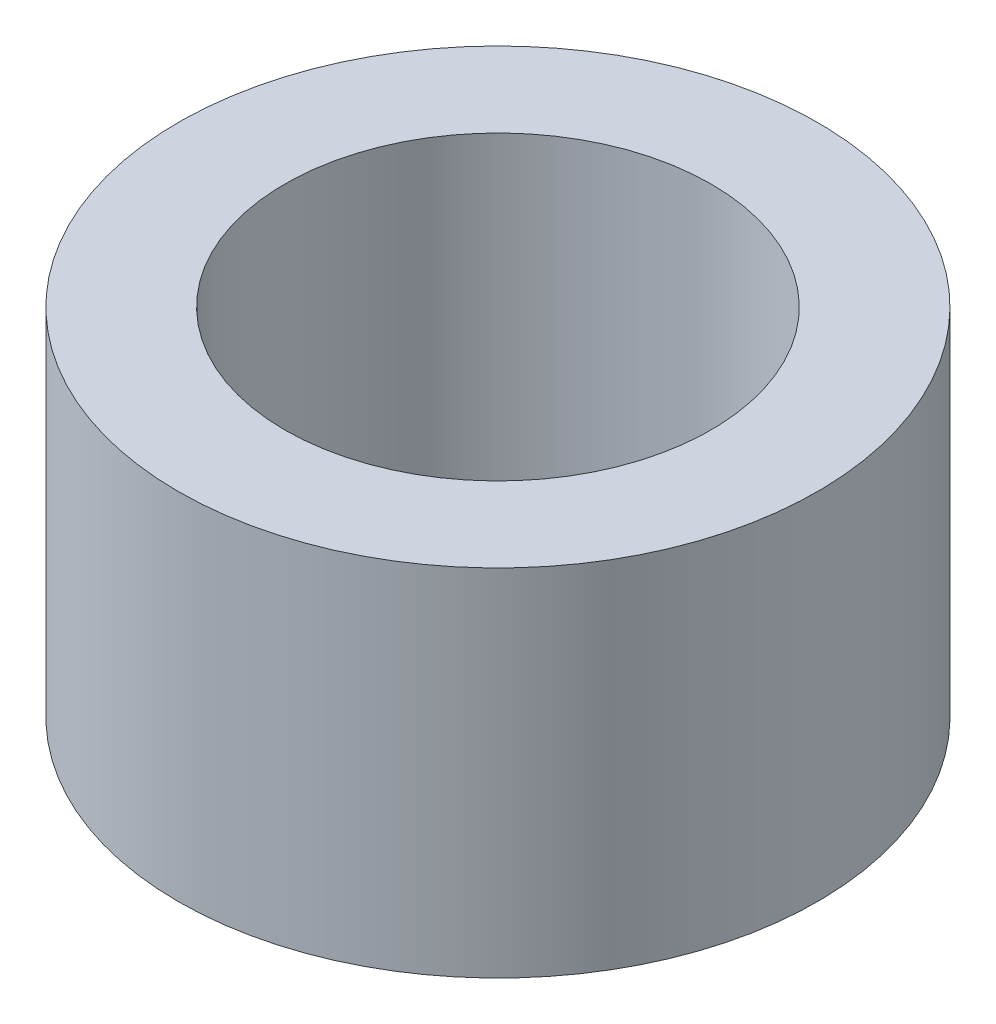
ISO-10303-21;
HEADER;
FILE_DESCRIPTION(('STEP AP214'),'2;1');
FILE_NAME('part.step','',(''),(''),'','','');
FILE_SCHEMA(('AUTOMOTIVE_DESIGN { 1 0 10303 214 1 1 1 1 }'));
ENDSEC;
DATA;
#1=APPLICATION_CONTEXT('core data for automotive mechanical design processes');
#2=APPLICATION_PROTOCOL_DEFINITION('international standard','automotive_design',2000,#1);
#3=PRODUCT_CONTEXT('',#1,'mechanical');
#4=PRODUCT('Part','Part','',(#3));
#5=PRODUCT_RELATED_PRODUCT_CATEGORY('part','',(#4));
#6=PRODUCT_DEFINITION_FORMATION('','',#4);
#7=PRODUCT_DEFINITION_CONTEXT('part definition',#1,'design');
#8=PRODUCT_DEFINITION('design','',#6,#7);
#9=PRODUCT_DEFINITION_SHAPE('','',#8);
#10=(LENGTH_UNIT() NAMED_UNIT(*) SI_UNIT(.MILLI.,.METRE.));
#11=(NAMED_UNIT(*) PLANE_ANGLE_UNIT() SI_UNIT($,.RADIAN.));
#12=(NAMED_UNIT(*) SI_UNIT($,.STERADIAN.) SOLID_ANGLE_UNIT());
#13=UNCERTAINTY_MEASURE_WITH_UNIT(LENGTH_MEASURE(1.E-05),#10,'distance_accuracy_value','');
#14=(GEOMETRIC_REPRESENTATION_CONTEXT(3) GLOBAL_UNCERTAINTY_ASSIGNED_CONTEXT((#13)) GLOBAL_UNIT_ASSIGNED_CONTEXT((#10,
#11,#12)) REPRESENTATION_CONTEXT('',''));
#15=CARTESIAN_POINT('',(0.,0.,0.));
#16=DIRECTION('',(0.,0.,1.));
#17=DIRECTION('',(1.,0.,0.));
#18=AXIS2_PLACEMENT_3D('',#15,#16,#17);
#19=CARTESIAN_POINT('',(0.,10.,0.));
#20=DIRECTION('',(0.,-1.,0.));
#21=DIRECTION('',(0.,0.,-1.));
#22=AXIS2_PLACEMENT_3D('',#19,#20,#21);
#23=CYLINDRICAL_SURFACE('',#22,9.);
#24=CARTESIAN_POINT('',(0.,10.,0.));
#25=DIRECTION('',(0.,1.,0.));
#26=DIRECTION('',(0.,0.,1.));
#27=AXIS2_PLACEMENT_3D('',#24,#25,#26);
#28=CIRCLE('',#27,9.);
#29=CARTESIAN_POINT('',(0.,10.,9.));
#30=VERTEX_POINT('',#29);
#31=EDGE_CURVE('E10',#30,#30,#28,.T.);
#32=ORIENTED_EDGE('',*,*,#31,.F.);
#33=EDGE_LOOP('',(#32));
#34=FACE_BOUND('',#33,.T.);
#35=CARTESIAN_POINT('',(0.,0.,0.));
#36=DIRECTION('',(0.,1.,0.));
#37=DIRECTION('',(0.,0.,1.));
#38=AXIS2_PLACEMENT_3D('',#35,#36,#37);
#39=CIRCLE('',#38,9.);
#40=CARTESIAN_POINT('',(0.,0.,9.));
#41=VERTEX_POINT('',#40);
#42=EDGE_CURVE('E32',#41,#41,#39,.T.);
#43=ORIENTED_EDGE('',*,*,#42,.T.);
#44=EDGE_LOOP('',(#43));
#45=FACE_BOUND('',#44,.T.);
#46=ADVANCED_FACE('F29',(#34,#45),#23,.T.);
#47=CARTESIAN_POINT('',(0.,10.,0.));
#48=DIRECTION('',(0.,1.,0.));
#49=DIRECTION('',(0.,0.,1.));
#50=AXIS2_PLACEMENT_3D('',#47,#48,#49);
#51=PLANE('',#50);
#52=CARTESIAN_POINT('',(0.,10.,0.));
#53=DIRECTION('',(0.,1.,0.));
#54=DIRECTION('',(0.,0.,1.));
#55=AXIS2_PLACEMENT_3D('',#52,#53,#54);
#56=CIRCLE('',#55,6.);
#57=CARTESIAN_POINT('',(0.,10.,6.));
#58=VERTEX_POINT('',#57);
#59=EDGE_CURVE('E41',#58,#58,#56,.T.);
#60=ORIENTED_EDGE('',*,*,#59,.F.);
#61=EDGE_LOOP('',(#60));
#62=FACE_BOUND('',#61,.T.);
#63=ORIENTED_EDGE('',*,*,#31,.T.);
#64=EDGE_LOOP('',(#63));
#65=FACE_BOUND('',#64,.T.);
#66=ADVANCED_FACE('F56',(#62,#65),#51,.T.);
#67=CARTESIAN_POINT('',(0.,0.,0.));
#68=DIRECTION('',(0.,1.,0.));
#69=DIRECTION('',(0.,0.,1.));
#70=AXIS2_PLACEMENT_3D('',#67,#68,#69);
#71=PLANE('',#70);
#72=CARTESIAN_POINT('',(0.,0.,0.));
#73=DIRECTION('',(0.,1.,0.));
#74=DIRECTION('',(0.,0.,1.));
#75=AXIS2_PLACEMENT_3D('',#72,#73,#74);
#76=CIRCLE('',#75,6.);
#77=CARTESIAN_POINT('',(0.,0.,6.));
#78=VERTEX_POINT('',#77);
#79=EDGE_CURVE('E39',#78,#78,#76,.T.);
#80=ORIENTED_EDGE('',*,*,#79,.T.);
#81=EDGE_LOOP('',(#80));
#82=FACE_BOUND('',#81,.T.);
#83=ORIENTED_EDGE('',*,*,#42,.F.);
#84=EDGE_LOOP('',(#83));
#85=FACE_BOUND('',#84,.T.);
#86=ADVANCED_FACE('F47',(#82,#85),#71,.F.);
#87=CARTESIAN_POINT('',(0.,0.,0.));
#88=DIRECTION('',(0.,1.,0.));
#89=DIRECTION('',(0.,0.,1.));
#90=AXIS2_PLACEMENT_3D('',#87,#88,#89);
#91=CYLINDRICAL_SURFACE('',#90,6.);
#92=ORIENTED_EDGE('',*,*,#79,.F.);
#93=EDGE_LOOP('',(#92));
#94=FACE_BOUND('',#93,.T.);
#95=ORIENTED_EDGE('',*,*,#59,.T.);
#96=EDGE_LOOP('',(#95));
#97=FACE_BOUND('',#96,.T.);
#98=ADVANCED_FACE('F50',(#94,#97),#91,.F.);
#99=CLOSED_SHELL('',(#46,#66,#86,#98));
#100=MANIFOLD_SOLID_BREP('B2',#99);
#101=ADVANCED_BREP_SHAPE_REPRESENTATION('',(#18,#100),#14);
#102=SHAPE_DEFINITION_REPRESENTATION(#9,#101);
ENDSEC;
END-ISO-10303-21;
